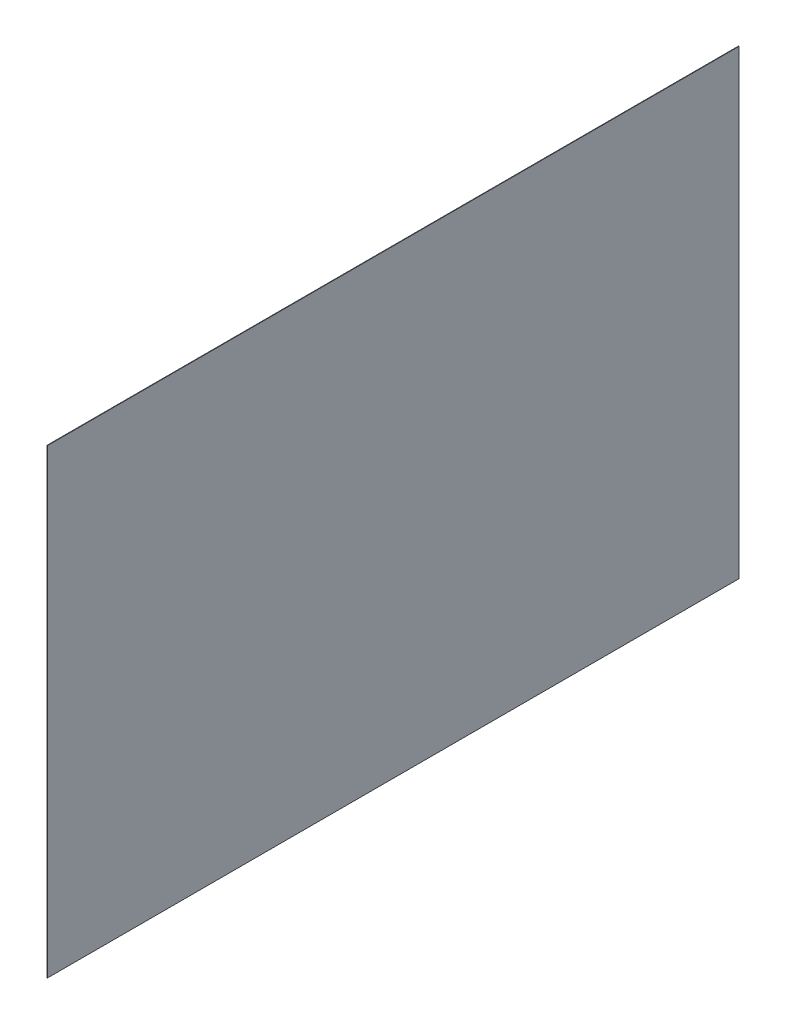
ISO-10303-21;
HEADER;
FILE_DESCRIPTION(('STEP AP214'),'2;1');
FILE_NAME('part.step','',(''),(''),'','','');
FILE_SCHEMA(('AUTOMOTIVE_DESIGN { 1 0 10303 214 1 1 1 1 }'));
ENDSEC;
DATA;
#1=APPLICATION_CONTEXT('core data for automotive mechanical design processes');
#2=APPLICATION_PROTOCOL_DEFINITION('international standard','automotive_design',2000,#1);
#3=PRODUCT_CONTEXT('',#1,'mechanical');
#4=PRODUCT('Part','Part','',(#3));
#5=PRODUCT_RELATED_PRODUCT_CATEGORY('part','',(#4));
#6=PRODUCT_DEFINITION_FORMATION('','',#4);
#7=PRODUCT_DEFINITION_CONTEXT('part definition',#1,'design');
#8=PRODUCT_DEFINITION('design','',#6,#7);
#9=PRODUCT_DEFINITION_SHAPE('','',#8);
#10=(LENGTH_UNIT() NAMED_UNIT(*) SI_UNIT(.MILLI.,.METRE.));
#11=(NAMED_UNIT(*) PLANE_ANGLE_UNIT() SI_UNIT($,.RADIAN.));
#12=(NAMED_UNIT(*) SI_UNIT($,.STERADIAN.) SOLID_ANGLE_UNIT());
#13=UNCERTAINTY_MEASURE_WITH_UNIT(LENGTH_MEASURE(1.E-05),#10,'distance_accuracy_value','');
#14=(GEOMETRIC_REPRESENTATION_CONTEXT(3) GLOBAL_UNCERTAINTY_ASSIGNED_CONTEXT((#13)) GLOBAL_UNIT_ASSIGNED_CONTEXT((#10,
#11,#12)) REPRESENTATION_CONTEXT('',''));
#15=CARTESIAN_POINT('',(0.,0.,0.));
#16=DIRECTION('',(0.,0.,1.));
#17=DIRECTION('',(1.,0.,0.));
#18=AXIS2_PLACEMENT_3D('',#15,#16,#17);
#19=CARTESIAN_POINT('',(2.54,-1219.2,-1828.8));
#20=DIRECTION('',(0.,0.,1.));
#21=DIRECTION('',(1.,0.,0.));
#22=AXIS2_PLACEMENT_3D('',#19,#20,#21);
#23=PLANE('',#22);
#24=DIRECTION('',(0.,1.,0.));
#25=VECTOR('',#24,1.);
#26=CARTESIAN_POINT('',(0.,-1219.2,-1828.8));
#27=LINE('',#26,#25);
#28=CARTESIAN_POINT('',(0.,-1219.2,-1828.8));
#29=VERTEX_POINT('',#28);
#30=CARTESIAN_POINT('',(0.,1219.2,-1828.8));
#31=VERTEX_POINT('',#30);
#32=EDGE_CURVE('E98',#29,#31,#27,.T.);
#33=ORIENTED_EDGE('',*,*,#32,.T.);
#34=DIRECTION('',(-1.,0.,0.));
#35=VECTOR('',#34,1.);
#36=CARTESIAN_POINT('',(2.54,1219.2,-1828.8));
#37=LINE('',#36,#35);
#38=CARTESIAN_POINT('',(2.54,1219.2,-1828.8));
#39=VERTEX_POINT('',#38);
#40=EDGE_CURVE('E11',#39,#31,#37,.T.);
#41=ORIENTED_EDGE('',*,*,#40,.F.);
#42=DIRECTION('',(0.,1.,0.));
#43=VECTOR('',#42,1.);
#44=CARTESIAN_POINT('',(2.54,-1219.2,-1828.8));
#45=LINE('',#44,#43);
#46=CARTESIAN_POINT('',(2.54,-1219.2,-1828.8));
#47=VERTEX_POINT('',#46);
#48=EDGE_CURVE('E86',#47,#39,#45,.T.);
#49=ORIENTED_EDGE('',*,*,#48,.F.);
#50=DIRECTION('',(-1.,0.,0.));
#51=VECTOR('',#50,1.);
#52=CARTESIAN_POINT('',(2.54,-1219.2,-1828.8));
#53=LINE('',#52,#51);
#54=EDGE_CURVE('E94',#47,#29,#53,.T.);
#55=ORIENTED_EDGE('',*,*,#54,.T.);
#56=EDGE_LOOP('',(#33,#41,#49,#55));
#57=FACE_BOUND('',#56,.T.);
#58=ADVANCED_FACE('F35',(#57),#23,.F.);
#59=CARTESIAN_POINT('',(2.54,1219.2,1828.8));
#60=DIRECTION('',(0.,-1.,0.));
#61=DIRECTION('',(0.,0.,-1.));
#62=AXIS2_PLACEMENT_3D('',#59,#60,#61);
#63=PLANE('',#62);
#64=DIRECTION('',(0.,0.,1.));
#65=VECTOR('',#64,1.);
#66=CARTESIAN_POINT('',(0.,1219.2,1828.8));
#67=LINE('',#66,#65);
#68=CARTESIAN_POINT('',(0.,1219.2,1828.8));
#69=VERTEX_POINT('',#68);
#70=EDGE_CURVE('E90',#31,#69,#67,.T.);
#71=ORIENTED_EDGE('',*,*,#70,.T.);
#72=DIRECTION('',(-1.,0.,0.));
#73=VECTOR('',#72,1.);
#74=CARTESIAN_POINT('',(2.54,1219.2,1828.8));
#75=LINE('',#74,#73);
#76=CARTESIAN_POINT('',(2.54,1219.2,1828.8));
#77=VERTEX_POINT('',#76);
#78=EDGE_CURVE('E43',#77,#69,#75,.T.);
#79=ORIENTED_EDGE('',*,*,#78,.F.);
#80=DIRECTION('',(0.,0.,1.));
#81=VECTOR('',#80,1.);
#82=CARTESIAN_POINT('',(2.54,1219.2,1828.8));
#83=LINE('',#82,#81);
#84=EDGE_CURVE('E81',#39,#77,#83,.T.);
#85=ORIENTED_EDGE('',*,*,#84,.F.);
#86=ORIENTED_EDGE('',*,*,#40,.T.);
#87=EDGE_LOOP('',(#71,#79,#85,#86));
#88=FACE_BOUND('',#87,.T.);
#89=ADVANCED_FACE('F89',(#88),#63,.F.);
#90=CARTESIAN_POINT('',(2.54,-1219.2,1828.8));
#91=DIRECTION('',(0.,0.,-1.));
#92=DIRECTION('',(-1.,0.,0.));
#93=AXIS2_PLACEMENT_3D('',#90,#91,#92);
#94=PLANE('',#93);
#95=DIRECTION('',(0.,-1.,0.));
#96=VECTOR('',#95,1.);
#97=CARTESIAN_POINT('',(0.,-1219.2,1828.8));
#98=LINE('',#97,#96);
#99=CARTESIAN_POINT('',(0.,-1219.2,1828.8));
#100=VERTEX_POINT('',#99);
#101=EDGE_CURVE('E68',#69,#100,#98,.T.);
#102=ORIENTED_EDGE('',*,*,#101,.T.);
#103=DIRECTION('',(-1.,0.,0.));
#104=VECTOR('',#103,1.);
#105=CARTESIAN_POINT('',(2.54,-1219.2,1828.8));
#106=LINE('',#105,#104);
#107=CARTESIAN_POINT('',(2.54,-1219.2,1828.8));
#108=VERTEX_POINT('',#107);
#109=EDGE_CURVE('E91',#108,#100,#106,.T.);
#110=ORIENTED_EDGE('',*,*,#109,.F.);
#111=DIRECTION('',(0.,-1.,0.));
#112=VECTOR('',#111,1.);
#113=CARTESIAN_POINT('',(2.54,-1219.2,1828.8));
#114=LINE('',#113,#112);
#115=EDGE_CURVE('E84',#77,#108,#114,.T.);
#116=ORIENTED_EDGE('',*,*,#115,.F.);
#117=ORIENTED_EDGE('',*,*,#78,.T.);
#118=EDGE_LOOP('',(#102,#110,#116,#117));
#119=FACE_BOUND('',#118,.T.);
#120=ADVANCED_FACE('F92',(#119),#94,.F.);
#121=CARTESIAN_POINT('',(2.54,-1219.2,1828.8));
#122=DIRECTION('',(0.,1.,0.));
#123=DIRECTION('',(0.,0.,1.));
#124=AXIS2_PLACEMENT_3D('',#121,#122,#123);
#125=PLANE('',#124);
#126=DIRECTION('',(0.,0.,-1.));
#127=VECTOR('',#126,1.);
#128=CARTESIAN_POINT('',(0.,-1219.2,1828.8));
#129=LINE('',#128,#127);
#130=EDGE_CURVE('E74',#100,#29,#129,.T.);
#131=ORIENTED_EDGE('',*,*,#130,.T.);
#132=ORIENTED_EDGE('',*,*,#54,.F.);
#133=DIRECTION('',(0.,0.,-1.));
#134=VECTOR('',#133,1.);
#135=CARTESIAN_POINT('',(2.54,-1219.2,1828.8));
#136=LINE('',#135,#134);
#137=EDGE_CURVE('E51',#108,#47,#136,.T.);
#138=ORIENTED_EDGE('',*,*,#137,.F.);
#139=ORIENTED_EDGE('',*,*,#109,.T.);
#140=EDGE_LOOP('',(#131,#132,#138,#139));
#141=FACE_BOUND('',#140,.T.);
#142=ADVANCED_FACE('F105',(#141),#125,.F.);
#143=CARTESIAN_POINT('',(2.54,0.,0.));
#144=DIRECTION('',(-1.,0.,0.));
#145=DIRECTION('',(0.,0.,1.));
#146=AXIS2_PLACEMENT_3D('',#143,#144,#145);
#147=PLANE('',#146);
#148=ORIENTED_EDGE('',*,*,#48,.T.);
#149=ORIENTED_EDGE('',*,*,#84,.T.);
#150=ORIENTED_EDGE('',*,*,#115,.T.);
#151=ORIENTED_EDGE('',*,*,#137,.T.);
#152=EDGE_LOOP('',(#148,#149,#150,#151));
#153=FACE_BOUND('',#152,.T.);
#154=ADVANCED_FACE('F82',(#153),#147,.F.);
#155=CARTESIAN_POINT('',(0.,0.,0.));
#156=DIRECTION('',(-1.,0.,0.));
#157=DIRECTION('',(0.,0.,1.));
#158=AXIS2_PLACEMENT_3D('',#155,#156,#157);
#159=PLANE('',#158);
#160=ORIENTED_EDGE('',*,*,#32,.F.);
#161=ORIENTED_EDGE('',*,*,#130,.F.);
#162=ORIENTED_EDGE('',*,*,#101,.F.);
#163=ORIENTED_EDGE('',*,*,#70,.F.);
#164=EDGE_LOOP('',(#160,#161,#162,#163));
#165=FACE_BOUND('',#164,.T.);
#166=ADVANCED_FACE('F108',(#165),#159,.T.);
#167=CLOSED_SHELL('',(#58,#89,#120,#142,#154,#166));
#168=MANIFOLD_SOLID_BREP('B2',#167);
#169=ADVANCED_BREP_SHAPE_REPRESENTATION('',(#18,#168),#14);
#170=SHAPE_DEFINITION_REPRESENTATION(#9,#169);
ENDSEC;
END-ISO-10303-21;
